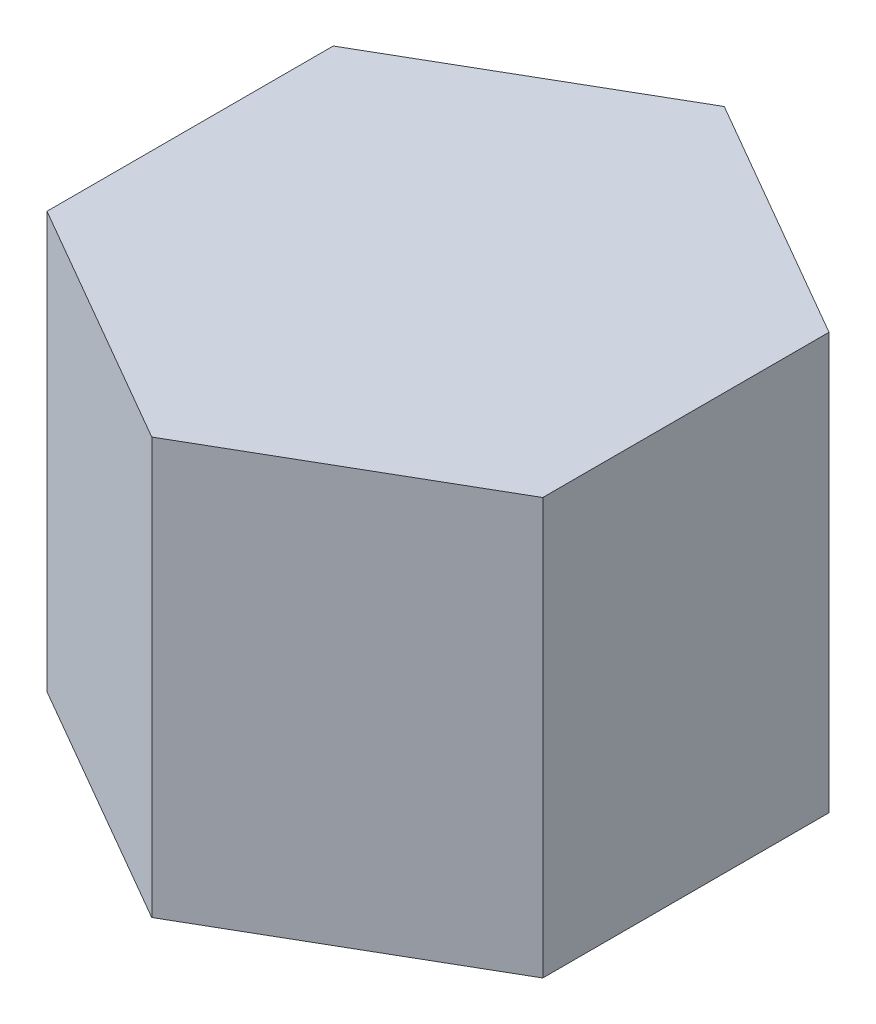
ISO-10303-21;
HEADER;
FILE_DESCRIPTION(('STEP AP214'),'2;1');
FILE_NAME('part.step','',(''),(''),'','','');
FILE_SCHEMA(('AUTOMOTIVE_DESIGN { 1 0 10303 214 1 1 1 1 }'));
ENDSEC;
DATA;
#1=APPLICATION_CONTEXT('core data for automotive mechanical design processes');
#2=APPLICATION_PROTOCOL_DEFINITION('international standard','automotive_design',2000,#1);
#3=PRODUCT_CONTEXT('',#1,'mechanical');
#4=PRODUCT('Part','Part','',(#3));
#5=PRODUCT_RELATED_PRODUCT_CATEGORY('part','',(#4));
#6=PRODUCT_DEFINITION_FORMATION('','',#4);
#7=PRODUCT_DEFINITION_CONTEXT('part definition',#1,'design');
#8=PRODUCT_DEFINITION('design','',#6,#7);
#9=PRODUCT_DEFINITION_SHAPE('','',#8);
#10=(LENGTH_UNIT() NAMED_UNIT(*) SI_UNIT(.MILLI.,.METRE.));
#11=(NAMED_UNIT(*) PLANE_ANGLE_UNIT() SI_UNIT($,.RADIAN.));
#12=(NAMED_UNIT(*) SI_UNIT($,.STERADIAN.) SOLID_ANGLE_UNIT());
#13=UNCERTAINTY_MEASURE_WITH_UNIT(LENGTH_MEASURE(1.E-05),#10,'distance_accuracy_value','');
#14=(GEOMETRIC_REPRESENTATION_CONTEXT(3) GLOBAL_UNCERTAINTY_ASSIGNED_CONTEXT((#13)) GLOBAL_UNIT_ASSIGNED_CONTEXT((#10,
#11,#12)) REPRESENTATION_CONTEXT('',''));
#15=CARTESIAN_POINT('',(0.,0.,0.));
#16=DIRECTION('',(0.,0.,1.));
#17=DIRECTION('',(1.,0.,0.));
#18=AXIS2_PLACEMENT_3D('',#15,#16,#17);
#19=CARTESIAN_POINT('',(201.839551417382,-147.556598747966,289.083895009141));
#20=DIRECTION('',(-0.499999999999943,0.,-0.866025403784471));
#21=DIRECTION('',(-0.866025403784471,0.,0.499999999999943));
#22=AXIS2_PLACEMENT_3D('',#19,#20,#21);
#23=PLANE('',#22);
#24=CARTESIAN_POINT('',(202.142660308706,-147.047793579175,288.908895009141));
#25=DIRECTION('',(-0.866025403784471,0.,0.499999999999943));
#26=VECTOR('',#25,1.);
#27=LINE('',#24,#26);
#28=CARTESIAN_POINT('',(202.142660308706,-147.047793579175,288.908895009141));
#29=VERTEX_POINT('',#28);
#30=CARTESIAN_POINT('',(201.839551417382,-147.047793579175,289.083895009141));
#31=VERTEX_POINT('',#30);
#32=EDGE_CURVE('E170',#29,#31,#27,.T.);
#33=ORIENTED_EDGE('',*,*,#32,.T.);
#34=CARTESIAN_POINT('',(201.839551417382,-147.556598747966,289.083895009141));
#35=DIRECTION('',(0.,1.,0.));
#36=VECTOR('',#35,1.);
#37=LINE('',#34,#36);
#38=CARTESIAN_POINT('',(201.839551417382,-147.556598747966,289.083895009141));
#39=VERTEX_POINT('',#38);
#40=EDGE_CURVE('E35',#39,#31,#37,.T.);
#41=ORIENTED_EDGE('',*,*,#40,.F.);
#42=CARTESIAN_POINT('',(202.142660308706,-147.556598747966,288.908895009141));
#43=DIRECTION('',(-0.866025403784471,0.,0.499999999999943));
#44=VECTOR('',#43,1.);
#45=LINE('',#42,#44);
#46=CARTESIAN_POINT('',(202.142660308706,-147.556598747966,288.908895009141));
#47=VERTEX_POINT('',#46);
#48=EDGE_CURVE('E159',#47,#39,#45,.T.);
#49=ORIENTED_EDGE('',*,*,#48,.F.);
#50=CARTESIAN_POINT('',(202.142660308706,-147.556598747966,288.908895009141));
#51=DIRECTION('',(0.,1.,0.));
#52=VECTOR('',#51,1.);
#53=LINE('',#50,#52);
#54=EDGE_CURVE('E10',#47,#29,#53,.T.);
#55=ORIENTED_EDGE('',*,*,#54,.T.);
#56=EDGE_LOOP('',(#33,#41,#49,#55));
#57=FACE_BOUND('',#56,.T.);
#58=ADVANCED_FACE('F16',(#57),#23,.F.);
#59=CARTESIAN_POINT('',(202.142660308706,-147.556598747966,291.594471220494));
#60=DIRECTION('',(-1.,0.,0.));
#61=DIRECTION('',(0.,-1.,0.));
#62=AXIS2_PLACEMENT_3D('',#59,#60,#61);
#63=PLANE('',#62);
#64=CARTESIAN_POINT('',(202.142660308706,-147.047793579175,288.558895009141));
#65=DIRECTION('',(0.,0.,1.));
#66=VECTOR('',#65,1.);
#67=LINE('',#64,#66);
#68=CARTESIAN_POINT('',(202.142660308706,-147.047793579175,288.558895009141));
#69=VERTEX_POINT('',#68);
#70=EDGE_CURVE('E167',#69,#29,#67,.T.);
#71=ORIENTED_EDGE('',*,*,#70,.T.);
#72=ORIENTED_EDGE('',*,*,#54,.F.);
#73=CARTESIAN_POINT('',(202.142660308706,-147.556598747966,288.558895009141));
#74=DIRECTION('',(0.,0.,1.));
#75=VECTOR('',#74,1.);
#76=LINE('',#73,#75);
#77=CARTESIAN_POINT('',(202.142660308706,-147.556598747966,288.558895009141));
#78=VERTEX_POINT('',#77);
#79=EDGE_CURVE('E156',#78,#47,#76,.T.);
#80=ORIENTED_EDGE('',*,*,#79,.F.);
#81=CARTESIAN_POINT('',(202.142660308706,-147.556598747966,288.558895009141));
#82=DIRECTION('',(0.,1.,0.));
#83=VECTOR('',#82,1.);
#84=LINE('',#81,#83);
#85=EDGE_CURVE('E27',#78,#69,#84,.T.);
#86=ORIENTED_EDGE('',*,*,#85,.T.);
#87=EDGE_LOOP('',(#71,#72,#80,#86));
#88=FACE_BOUND('',#87,.T.);
#89=ADVANCED_FACE('F189',(#88),#63,.F.);
#90=CARTESIAN_POINT('',(202.142660308706,-147.556598747966,288.558895009141));
#91=DIRECTION('',(-0.499999999999978,0.,0.866025403784452));
#92=DIRECTION('',(0.866025403784452,0.,0.499999999999978));
#93=AXIS2_PLACEMENT_3D('',#90,#91,#92);
#94=PLANE('',#93);
#95=CARTESIAN_POINT('',(201.839551417382,-147.047793579175,288.383895009141));
#96=DIRECTION('',(0.866025403784452,0.,0.499999999999978));
#97=VECTOR('',#96,1.);
#98=LINE('',#95,#97);
#99=CARTESIAN_POINT('',(201.839551417382,-147.047793579175,288.383895009141));
#100=VERTEX_POINT('',#99);
#101=EDGE_CURVE('E163',#100,#69,#98,.T.);
#102=ORIENTED_EDGE('',*,*,#101,.T.);
#103=ORIENTED_EDGE('',*,*,#85,.F.);
#104=CARTESIAN_POINT('',(201.839551417382,-147.556598747966,288.383895009141));
#105=DIRECTION('',(0.866025403784452,0.,0.499999999999978));
#106=VECTOR('',#105,1.);
#107=LINE('',#104,#106);
#108=CARTESIAN_POINT('',(201.839551417382,-147.556598747966,288.383895009141));
#109=VERTEX_POINT('',#108);
#110=EDGE_CURVE('E106',#109,#78,#107,.T.);
#111=ORIENTED_EDGE('',*,*,#110,.F.);
#112=CARTESIAN_POINT('',(201.839551417382,-147.556598747966,288.383895009141));
#113=DIRECTION('',(0.,1.,0.));
#114=VECTOR('',#113,1.);
#115=LINE('',#112,#114);
#116=EDGE_CURVE('E94',#109,#100,#115,.T.);
#117=ORIENTED_EDGE('',*,*,#116,.T.);
#118=EDGE_LOOP('',(#102,#103,#111,#117));
#119=FACE_BOUND('',#118,.T.);
#120=ADVANCED_FACE('F198',(#119),#94,.F.);
#121=CARTESIAN_POINT('',(201.839551417382,-147.556598747966,288.383895009141));
#122=DIRECTION('',(0.499999999999978,0.,0.866025403784452));
#123=DIRECTION('',(0.866025403784452,0.,-0.499999999999978));
#124=AXIS2_PLACEMENT_3D('',#121,#122,#123);
#125=PLANE('',#124);
#126=CARTESIAN_POINT('',(201.536442526057,-147.047793579175,288.558895009141));
#127=DIRECTION('',(0.866025403784452,0.,-0.499999999999978));
#128=VECTOR('',#127,1.);
#129=LINE('',#126,#128);
#130=CARTESIAN_POINT('',(201.536442526057,-147.047793579175,288.558895009141));
#131=VERTEX_POINT('',#130);
#132=EDGE_CURVE('E162',#131,#100,#129,.T.);
#133=ORIENTED_EDGE('',*,*,#132,.T.);
#134=ORIENTED_EDGE('',*,*,#116,.F.);
#135=CARTESIAN_POINT('',(201.536442526057,-147.556598747966,288.558895009141));
#136=DIRECTION('',(0.866025403784452,0.,-0.499999999999978));
#137=VECTOR('',#136,1.);
#138=LINE('',#135,#137);
#139=CARTESIAN_POINT('',(201.536442526057,-147.556598747966,288.558895009141));
#140=VERTEX_POINT('',#139);
#141=EDGE_CURVE('E98',#140,#109,#138,.T.);
#142=ORIENTED_EDGE('',*,*,#141,.F.);
#143=CARTESIAN_POINT('',(201.536442526057,-147.556598747966,288.558895009141));
#144=DIRECTION('',(0.,1.,0.));
#145=VECTOR('',#144,1.);
#146=LINE('',#143,#145);
#147=EDGE_CURVE('E79',#140,#131,#146,.T.);
#148=ORIENTED_EDGE('',*,*,#147,.T.);
#149=EDGE_LOOP('',(#133,#134,#142,#148));
#150=FACE_BOUND('',#149,.T.);
#151=ADVANCED_FACE('F100',(#150),#125,.F.);
#152=CARTESIAN_POINT('',(201.536442526057,-147.556598747966,291.594471220494));
#153=DIRECTION('',(1.,0.,0.));
#154=DIRECTION('',(0.,1.,0.));
#155=AXIS2_PLACEMENT_3D('',#152,#153,#154);
#156=PLANE('',#155);
#157=CARTESIAN_POINT('',(201.536442526057,-147.047793579175,288.908895009141));
#158=DIRECTION('',(0.,0.,-1.));
#159=VECTOR('',#158,1.);
#160=LINE('',#157,#159);
#161=CARTESIAN_POINT('',(201.536442526057,-147.047793579175,288.908895009141));
#162=VERTEX_POINT('',#161);
#163=EDGE_CURVE('E88',#162,#131,#160,.T.);
#164=ORIENTED_EDGE('',*,*,#163,.T.);
#165=ORIENTED_EDGE('',*,*,#147,.F.);
#166=CARTESIAN_POINT('',(201.536442526057,-147.556598747966,288.908895009141));
#167=DIRECTION('',(0.,0.,-1.));
#168=VECTOR('',#167,1.);
#169=LINE('',#166,#168);
#170=CARTESIAN_POINT('',(201.536442526057,-147.556598747966,288.908895009141));
#171=VERTEX_POINT('',#170);
#172=EDGE_CURVE('E84',#171,#140,#169,.T.);
#173=ORIENTED_EDGE('',*,*,#172,.F.);
#174=CARTESIAN_POINT('',(201.536442526057,-147.556598747966,288.908895009141));
#175=DIRECTION('',(0.,1.,0.));
#176=VECTOR('',#175,1.);
#177=LINE('',#174,#176);
#178=EDGE_CURVE('E58',#171,#162,#177,.T.);
#179=ORIENTED_EDGE('',*,*,#178,.T.);
#180=EDGE_LOOP('',(#164,#165,#173,#179));
#181=FACE_BOUND('',#180,.T.);
#182=ADVANCED_FACE('F82',(#181),#156,.F.);
#183=CARTESIAN_POINT('',(201.536442526057,-147.556598747966,288.908895009141));
#184=DIRECTION('',(0.499999999999943,0.,-0.866025403784471));
#185=DIRECTION('',(-0.866025403784471,0.,-0.499999999999943));
#186=AXIS2_PLACEMENT_3D('',#183,#184,#185);
#187=PLANE('',#186);
#188=CARTESIAN_POINT('',(201.839551417382,-147.047793579175,289.083895009141));
#189=DIRECTION('',(-0.866025403784471,0.,-0.499999999999943));
#190=VECTOR('',#189,1.);
#191=LINE('',#188,#190);
#192=EDGE_CURVE('E160',#31,#162,#191,.T.);
#193=ORIENTED_EDGE('',*,*,#192,.T.);
#194=ORIENTED_EDGE('',*,*,#178,.F.);
#195=CARTESIAN_POINT('',(201.839551417382,-147.556598747966,289.083895009141));
#196=DIRECTION('',(-0.866025403784471,0.,-0.499999999999943));
#197=VECTOR('',#196,1.);
#198=LINE('',#195,#197);
#199=EDGE_CURVE('E112',#39,#171,#198,.T.);
#200=ORIENTED_EDGE('',*,*,#199,.F.);
#201=ORIENTED_EDGE('',*,*,#40,.T.);
#202=EDGE_LOOP('',(#193,#194,#200,#201));
#203=FACE_BOUND('',#202,.T.);
#204=ADVANCED_FACE('F131',(#203),#187,.F.);
#205=CARTESIAN_POINT('',(206.491105863044,-147.556598747966,291.594471220494));
#206=DIRECTION('',(0.,1.,0.));
#207=DIRECTION('',(-1.,0.,0.));
#208=AXIS2_PLACEMENT_3D('',#205,#206,#207);
#209=PLANE('',#208);
#210=ORIENTED_EDGE('',*,*,#48,.T.);
#211=ORIENTED_EDGE('',*,*,#199,.T.);
#212=ORIENTED_EDGE('',*,*,#172,.T.);
#213=ORIENTED_EDGE('',*,*,#141,.T.);
#214=ORIENTED_EDGE('',*,*,#110,.T.);
#215=ORIENTED_EDGE('',*,*,#79,.T.);
#216=EDGE_LOOP('',(#210,#211,#212,#213,#214,#215));
#217=FACE_BOUND('',#216,.T.);
#218=ADVANCED_FACE('F111',(#217),#209,.F.);
#219=CARTESIAN_POINT('',(206.491105863044,-147.047793579175,291.594471220494));
#220=DIRECTION('',(0.,1.,0.));
#221=DIRECTION('',(-1.,0.,0.));
#222=AXIS2_PLACEMENT_3D('',#219,#220,#221);
#223=PLANE('',#222);
#224=ORIENTED_EDGE('',*,*,#32,.F.);
#225=ORIENTED_EDGE('',*,*,#70,.F.);
#226=ORIENTED_EDGE('',*,*,#101,.F.);
#227=ORIENTED_EDGE('',*,*,#132,.F.);
#228=ORIENTED_EDGE('',*,*,#163,.F.);
#229=ORIENTED_EDGE('',*,*,#192,.F.);
#230=EDGE_LOOP('',(#224,#225,#226,#227,#228,#229));
#231=FACE_BOUND('',#230,.T.);
#232=ADVANCED_FACE('F130',(#231),#223,.T.);
#233=CLOSED_SHELL('',(#58,#89,#120,#151,#182,#204,#218,#232));
#234=MANIFOLD_SOLID_BREP('B1',#233);
#235=ADVANCED_BREP_SHAPE_REPRESENTATION('',(#18,#234),#14);
#236=SHAPE_DEFINITION_REPRESENTATION(#9,#235);
ENDSEC;
END-ISO-10303-21;
